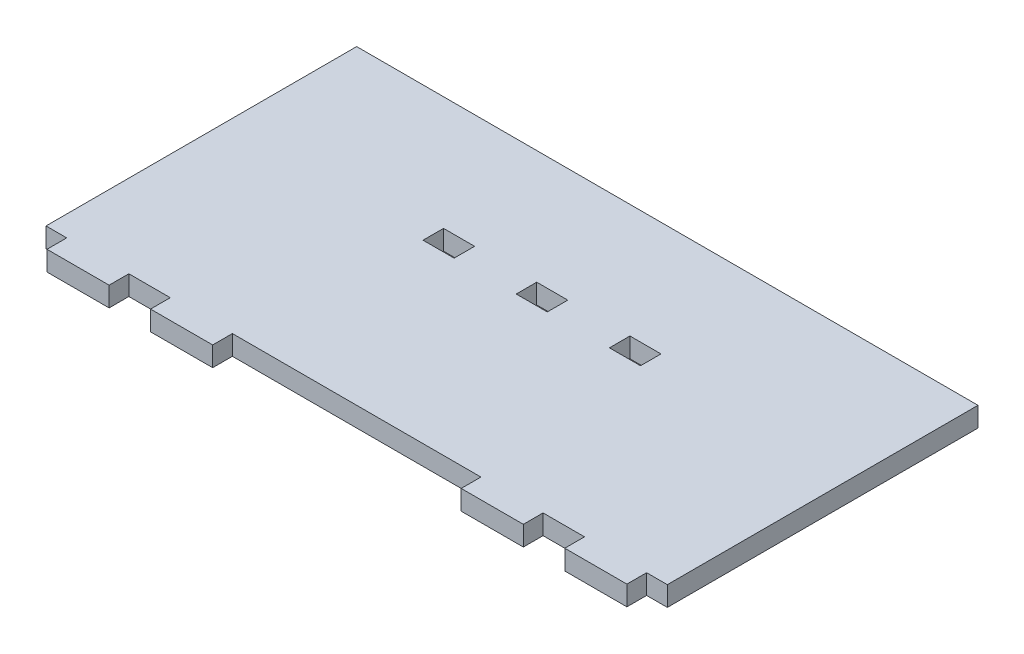
ISO-10303-21;
HEADER;
FILE_DESCRIPTION(('STEP AP214'),'2;1');
FILE_NAME('part.step','',(''),(''),'','','');
FILE_SCHEMA(('AUTOMOTIVE_DESIGN { 1 0 10303 214 1 1 1 1 }'));
ENDSEC;
DATA;
#1=APPLICATION_CONTEXT('core data for automotive mechanical design processes');
#2=APPLICATION_PROTOCOL_DEFINITION('international standard','automotive_design',2000,#1);
#3=PRODUCT_CONTEXT('',#1,'mechanical');
#4=PRODUCT('Part','Part','',(#3));
#5=PRODUCT_RELATED_PRODUCT_CATEGORY('part','',(#4));
#6=PRODUCT_DEFINITION_FORMATION('','',#4);
#7=PRODUCT_DEFINITION_CONTEXT('part definition',#1,'design');
#8=PRODUCT_DEFINITION('design','',#6,#7);
#9=PRODUCT_DEFINITION_SHAPE('','',#8);
#10=(LENGTH_UNIT() NAMED_UNIT(*) SI_UNIT(.MILLI.,.METRE.));
#11=(NAMED_UNIT(*) PLANE_ANGLE_UNIT() SI_UNIT($,.RADIAN.));
#12=(NAMED_UNIT(*) SI_UNIT($,.STERADIAN.) SOLID_ANGLE_UNIT());
#13=UNCERTAINTY_MEASURE_WITH_UNIT(LENGTH_MEASURE(1.E-05),#10,'distance_accuracy_value','');
#14=(GEOMETRIC_REPRESENTATION_CONTEXT(3) GLOBAL_UNCERTAINTY_ASSIGNED_CONTEXT((#13)) GLOBAL_UNIT_ASSIGNED_CONTEXT((#10,
#11,#12)) REPRESENTATION_CONTEXT('',''));
#15=CARTESIAN_POINT('',(0.,0.,0.));
#16=DIRECTION('',(0.,0.,1.));
#17=DIRECTION('',(1.,0.,0.));
#18=AXIS2_PLACEMENT_3D('',#15,#16,#17);
#19=CARTESIAN_POINT('',(46.6666666666666,3.175,25.));
#20=DIRECTION('',(0.,0.,-1.));
#21=DIRECTION('',(-1.,0.,0.));
#22=AXIS2_PLACEMENT_3D('',#19,#20,#21);
#23=PLANE('',#22);
#24=DIRECTION('',(1.,0.,0.));
#25=VECTOR('',#24,1.);
#26=CARTESIAN_POINT('',(46.6666666666666,0.,25.));
#27=LINE('',#26,#25);
#28=CARTESIAN_POINT('',(46.6666666666666,0.,25.));
#29=VERTEX_POINT('',#28);
#30=CARTESIAN_POINT('',(50.,0.,25.));
#31=VERTEX_POINT('',#30);
#32=EDGE_CURVE('E339',#29,#31,#27,.T.);
#33=ORIENTED_EDGE('',*,*,#32,.T.);
#34=DIRECTION('',(0.,-1.,0.));
#35=VECTOR('',#34,1.);
#36=CARTESIAN_POINT('',(50.,3.175,25.));
#37=LINE('',#36,#35);
#38=CARTESIAN_POINT('',(50.,3.175,25.));
#39=VERTEX_POINT('',#38);
#40=EDGE_CURVE('E11',#39,#31,#37,.T.);
#41=ORIENTED_EDGE('',*,*,#40,.F.);
#42=DIRECTION('',(1.,0.,0.));
#43=VECTOR('',#42,1.);
#44=CARTESIAN_POINT('',(46.6666666666666,3.175,25.));
#45=LINE('',#44,#43);
#46=CARTESIAN_POINT('',(46.6666666666666,3.175,25.));
#47=VERTEX_POINT('',#46);
#48=EDGE_CURVE('E346',#47,#39,#45,.T.);
#49=ORIENTED_EDGE('',*,*,#48,.F.);
#50=DIRECTION('',(0.,-1.,0.));
#51=VECTOR('',#50,1.);
#52=CARTESIAN_POINT('',(46.6666666666666,3.175,25.));
#53=LINE('',#52,#51);
#54=EDGE_CURVE('E388',#47,#29,#53,.T.);
#55=ORIENTED_EDGE('',*,*,#54,.T.);
#56=EDGE_LOOP('',(#33,#41,#49,#55));
#57=FACE_BOUND('',#56,.T.);
#58=ADVANCED_FACE('F36',(#57),#23,.F.);
#59=CARTESIAN_POINT('',(50.,3.175,-25.));
#60=DIRECTION('',(-1.,0.,0.));
#61=DIRECTION('',(0.,0.,1.));
#62=AXIS2_PLACEMENT_3D('',#59,#60,#61);
#63=PLANE('',#62);
#64=DIRECTION('',(0.,0.,-1.));
#65=VECTOR('',#64,1.);
#66=CARTESIAN_POINT('',(50.,0.,-25.));
#67=LINE('',#66,#65);
#68=CARTESIAN_POINT('',(50.,0.,-25.));
#69=VERTEX_POINT('',#68);
#70=EDGE_CURVE('E391',#31,#69,#67,.T.);
#71=ORIENTED_EDGE('',*,*,#70,.T.);
#72=DIRECTION('',(0.,-1.,0.));
#73=VECTOR('',#72,1.);
#74=CARTESIAN_POINT('',(50.,3.175,-25.));
#75=LINE('',#74,#73);
#76=CARTESIAN_POINT('',(50.,3.175,-25.));
#77=VERTEX_POINT('',#76);
#78=EDGE_CURVE('E43',#77,#69,#75,.T.);
#79=ORIENTED_EDGE('',*,*,#78,.F.);
#80=DIRECTION('',(0.,0.,-1.));
#81=VECTOR('',#80,1.);
#82=CARTESIAN_POINT('',(50.,3.175,-25.));
#83=LINE('',#82,#81);
#84=EDGE_CURVE('E349',#39,#77,#83,.T.);
#85=ORIENTED_EDGE('',*,*,#84,.F.);
#86=ORIENTED_EDGE('',*,*,#40,.T.);
#87=EDGE_LOOP('',(#71,#79,#85,#86));
#88=FACE_BOUND('',#87,.T.);
#89=ADVANCED_FACE('F507',(#88),#63,.F.);
#90=CARTESIAN_POINT('',(-50.0000000000001,3.175,-25.));
#91=DIRECTION('',(0.,0.,1.));
#92=DIRECTION('',(1.,0.,0.));
#93=AXIS2_PLACEMENT_3D('',#90,#91,#92);
#94=PLANE('',#93);
#95=DIRECTION('',(-1.,0.,0.));
#96=VECTOR('',#95,1.);
#97=CARTESIAN_POINT('',(-50.0000000000001,0.,-25.));
#98=LINE('',#97,#96);
#99=CARTESIAN_POINT('',(-50.0000000000001,0.,-25.));
#100=VERTEX_POINT('',#99);
#101=EDGE_CURVE('E393',#69,#100,#98,.T.);
#102=ORIENTED_EDGE('',*,*,#101,.T.);
#103=DIRECTION('',(0.,-1.,0.));
#104=VECTOR('',#103,1.);
#105=CARTESIAN_POINT('',(-50.0000000000001,3.175,-25.));
#106=LINE('',#105,#104);
#107=CARTESIAN_POINT('',(-50.0000000000001,3.175,-25.));
#108=VERTEX_POINT('',#107);
#109=EDGE_CURVE('E478',#108,#100,#106,.T.);
#110=ORIENTED_EDGE('',*,*,#109,.F.);
#111=DIRECTION('',(-1.,0.,0.));
#112=VECTOR('',#111,1.);
#113=CARTESIAN_POINT('',(-50.0000000000001,3.175,-25.));
#114=LINE('',#113,#112);
#115=EDGE_CURVE('E352',#77,#108,#114,.T.);
#116=ORIENTED_EDGE('',*,*,#115,.F.);
#117=ORIENTED_EDGE('',*,*,#78,.T.);
#118=EDGE_LOOP('',(#102,#110,#116,#117));
#119=FACE_BOUND('',#118,.T.);
#120=ADVANCED_FACE('F485',(#119),#94,.F.);
#121=CARTESIAN_POINT('',(-50.0000000000001,3.175,-25.));
#122=DIRECTION('',(1.,0.,0.));
#123=DIRECTION('',(0.,0.,-1.));
#124=AXIS2_PLACEMENT_3D('',#121,#122,#123);
#125=PLANE('',#124);
#126=DIRECTION('',(0.,0.,1.));
#127=VECTOR('',#126,1.);
#128=CARTESIAN_POINT('',(-50.0000000000001,0.,-25.));
#129=LINE('',#128,#127);
#130=CARTESIAN_POINT('',(-50.0000000000001,0.,25.));
#131=VERTEX_POINT('',#130);
#132=EDGE_CURVE('E395',#100,#131,#129,.T.);
#133=ORIENTED_EDGE('',*,*,#132,.T.);
#134=DIRECTION('',(0.,-1.,0.));
#135=VECTOR('',#134,1.);
#136=CARTESIAN_POINT('',(-50.0000000000001,3.175,25.));
#137=LINE('',#136,#135);
#138=CARTESIAN_POINT('',(-50.0000000000001,3.175,25.));
#139=VERTEX_POINT('',#138);
#140=EDGE_CURVE('E475',#139,#131,#137,.T.);
#141=ORIENTED_EDGE('',*,*,#140,.F.);
#142=DIRECTION('',(0.,0.,1.));
#143=VECTOR('',#142,1.);
#144=CARTESIAN_POINT('',(-50.0000000000001,3.175,-25.));
#145=LINE('',#144,#143);
#146=EDGE_CURVE('E354',#108,#139,#145,.T.);
#147=ORIENTED_EDGE('',*,*,#146,.F.);
#148=ORIENTED_EDGE('',*,*,#109,.T.);
#149=EDGE_LOOP('',(#133,#141,#147,#148));
#150=FACE_BOUND('',#149,.T.);
#151=ADVANCED_FACE('F495',(#150),#125,.F.);
#152=CARTESIAN_POINT('',(-50.0000000000001,3.175,25.));
#153=DIRECTION('',(0.,0.,-1.));
#154=DIRECTION('',(-1.,0.,0.));
#155=AXIS2_PLACEMENT_3D('',#152,#153,#154);
#156=PLANE('',#155);
#157=DIRECTION('',(1.,0.,0.));
#158=VECTOR('',#157,1.);
#159=CARTESIAN_POINT('',(-50.0000000000001,0.,25.));
#160=LINE('',#159,#158);
#161=CARTESIAN_POINT('',(-46.6666666666667,0.,25.));
#162=VERTEX_POINT('',#161);
#163=EDGE_CURVE('E397',#131,#162,#160,.T.);
#164=ORIENTED_EDGE('',*,*,#163,.T.);
#165=DIRECTION('',(0.,-1.,0.));
#166=VECTOR('',#165,1.);
#167=CARTESIAN_POINT('',(-46.6666666666667,3.175,25.));
#168=LINE('',#167,#166);
#169=CARTESIAN_POINT('',(-46.6666666666667,3.175,25.));
#170=VERTEX_POINT('',#169);
#171=EDGE_CURVE('E472',#170,#162,#168,.T.);
#172=ORIENTED_EDGE('',*,*,#171,.F.);
#173=DIRECTION('',(1.,0.,0.));
#174=VECTOR('',#173,1.);
#175=CARTESIAN_POINT('',(-50.0000000000001,3.175,25.));
#176=LINE('',#175,#174);
#177=EDGE_CURVE('E356',#139,#170,#176,.T.);
#178=ORIENTED_EDGE('',*,*,#177,.F.);
#179=ORIENTED_EDGE('',*,*,#140,.T.);
#180=EDGE_LOOP('',(#164,#172,#178,#179));
#181=FACE_BOUND('',#180,.T.);
#182=ADVANCED_FACE('F499',(#181),#156,.F.);
#183=CARTESIAN_POINT('',(-46.6666666666667,3.175,25.));
#184=DIRECTION('',(1.,0.,0.));
#185=DIRECTION('',(0.,0.,-1.));
#186=AXIS2_PLACEMENT_3D('',#183,#184,#185);
#187=PLANE('',#186);
#188=DIRECTION('',(0.,0.,1.));
#189=VECTOR('',#188,1.);
#190=CARTESIAN_POINT('',(-46.6666666666667,0.,25.));
#191=LINE('',#190,#189);
#192=CARTESIAN_POINT('',(-46.6666666666666,0.,28.175));
#193=VERTEX_POINT('',#192);
#194=EDGE_CURVE('E399',#162,#193,#191,.T.);
#195=ORIENTED_EDGE('',*,*,#194,.T.);
#196=DIRECTION('',(0.,-1.,0.));
#197=VECTOR('',#196,1.);
#198=CARTESIAN_POINT('',(-46.6666666666666,3.175,28.175));
#199=LINE('',#198,#197);
#200=CARTESIAN_POINT('',(-46.6666666666666,3.175,28.175));
#201=VERTEX_POINT('',#200);
#202=EDGE_CURVE('E469',#201,#193,#199,.T.);
#203=ORIENTED_EDGE('',*,*,#202,.F.);
#204=DIRECTION('',(0.,0.,1.));
#205=VECTOR('',#204,1.);
#206=CARTESIAN_POINT('',(-46.6666666666667,3.175,25.));
#207=LINE('',#206,#205);
#208=EDGE_CURVE('E358',#170,#201,#207,.T.);
#209=ORIENTED_EDGE('',*,*,#208,.F.);
#210=ORIENTED_EDGE('',*,*,#171,.T.);
#211=EDGE_LOOP('',(#195,#203,#209,#210));
#212=FACE_BOUND('',#211,.T.);
#213=ADVANCED_FACE('F580',(#212),#187,.F.);
#214=CARTESIAN_POINT('',(-46.6666666666666,3.175,28.175));
#215=DIRECTION('',(0.,0.,-1.));
#216=DIRECTION('',(-1.,0.,0.));
#217=AXIS2_PLACEMENT_3D('',#214,#215,#216);
#218=PLANE('',#217);
#219=DIRECTION('',(1.,0.,0.));
#220=VECTOR('',#219,1.);
#221=CARTESIAN_POINT('',(-46.6666666666666,0.,28.175));
#222=LINE('',#221,#220);
#223=CARTESIAN_POINT('',(-36.6666666666666,0.,28.175));
#224=VERTEX_POINT('',#223);
#225=EDGE_CURVE('E401',#193,#224,#222,.T.);
#226=ORIENTED_EDGE('',*,*,#225,.T.);
#227=DIRECTION('',(0.,-1.,0.));
#228=VECTOR('',#227,1.);
#229=CARTESIAN_POINT('',(-36.6666666666666,3.175,28.175));
#230=LINE('',#229,#228);
#231=CARTESIAN_POINT('',(-36.6666666666666,3.175,28.175));
#232=VERTEX_POINT('',#231);
#233=EDGE_CURVE('E466',#232,#224,#230,.T.);
#234=ORIENTED_EDGE('',*,*,#233,.F.);
#235=DIRECTION('',(1.,0.,0.));
#236=VECTOR('',#235,1.);
#237=CARTESIAN_POINT('',(-46.6666666666666,3.175,28.175));
#238=LINE('',#237,#236);
#239=EDGE_CURVE('E360',#201,#232,#238,.T.);
#240=ORIENTED_EDGE('',*,*,#239,.F.);
#241=ORIENTED_EDGE('',*,*,#202,.T.);
#242=EDGE_LOOP('',(#226,#234,#240,#241));
#243=FACE_BOUND('',#242,.T.);
#244=ADVANCED_FACE('F578',(#243),#218,.F.);
#245=CARTESIAN_POINT('',(-36.6666666666667,3.175,25.));
#246=DIRECTION('',(-1.,0.,0.));
#247=DIRECTION('',(0.,0.,1.));
#248=AXIS2_PLACEMENT_3D('',#245,#246,#247);
#249=PLANE('',#248);
#250=DIRECTION('',(0.,0.,-1.));
#251=VECTOR('',#250,1.);
#252=CARTESIAN_POINT('',(-36.6666666666667,0.,25.));
#253=LINE('',#252,#251);
#254=CARTESIAN_POINT('',(-36.6666666666667,0.,25.));
#255=VERTEX_POINT('',#254);
#256=EDGE_CURVE('E403',#224,#255,#253,.T.);
#257=ORIENTED_EDGE('',*,*,#256,.T.);
#258=DIRECTION('',(0.,-1.,0.));
#259=VECTOR('',#258,1.);
#260=CARTESIAN_POINT('',(-36.6666666666667,3.175,25.));
#261=LINE('',#260,#259);
#262=CARTESIAN_POINT('',(-36.6666666666667,3.175,25.));
#263=VERTEX_POINT('',#262);
#264=EDGE_CURVE('E463',#263,#255,#261,.T.);
#265=ORIENTED_EDGE('',*,*,#264,.F.);
#266=DIRECTION('',(0.,0.,-1.));
#267=VECTOR('',#266,1.);
#268=CARTESIAN_POINT('',(-36.6666666666667,3.175,25.));
#269=LINE('',#268,#267);
#270=EDGE_CURVE('E362',#232,#263,#269,.T.);
#271=ORIENTED_EDGE('',*,*,#270,.F.);
#272=ORIENTED_EDGE('',*,*,#233,.T.);
#273=EDGE_LOOP('',(#257,#265,#271,#272));
#274=FACE_BOUND('',#273,.T.);
#275=ADVANCED_FACE('F573',(#274),#249,.F.);
#276=CARTESIAN_POINT('',(-36.6666666666667,3.175,25.));
#277=DIRECTION('',(0.,0.,-1.));
#278=DIRECTION('',(-1.,0.,0.));
#279=AXIS2_PLACEMENT_3D('',#276,#277,#278);
#280=PLANE('',#279);
#281=DIRECTION('',(1.,0.,0.));
#282=VECTOR('',#281,1.);
#283=CARTESIAN_POINT('',(-36.6666666666667,0.,25.));
#284=LINE('',#283,#282);
#285=CARTESIAN_POINT('',(-30.0000000000001,0.,25.));
#286=VERTEX_POINT('',#285);
#287=EDGE_CURVE('E405',#255,#286,#284,.T.);
#288=ORIENTED_EDGE('',*,*,#287,.T.);
#289=DIRECTION('',(0.,-1.,0.));
#290=VECTOR('',#289,1.);
#291=CARTESIAN_POINT('',(-30.0000000000001,3.175,25.));
#292=LINE('',#291,#290);
#293=CARTESIAN_POINT('',(-30.0000000000001,3.175,25.));
#294=VERTEX_POINT('',#293);
#295=EDGE_CURVE('E460',#294,#286,#292,.T.);
#296=ORIENTED_EDGE('',*,*,#295,.F.);
#297=DIRECTION('',(1.,0.,0.));
#298=VECTOR('',#297,1.);
#299=CARTESIAN_POINT('',(-36.6666666666667,3.175,25.));
#300=LINE('',#299,#298);
#301=EDGE_CURVE('E364',#263,#294,#300,.T.);
#302=ORIENTED_EDGE('',*,*,#301,.F.);
#303=ORIENTED_EDGE('',*,*,#264,.T.);
#304=EDGE_LOOP('',(#288,#296,#302,#303));
#305=FACE_BOUND('',#304,.T.);
#306=ADVANCED_FACE('F568',(#305),#280,.F.);
#307=CARTESIAN_POINT('',(-30.0000000000001,3.175,25.));
#308=DIRECTION('',(1.,0.,0.));
#309=DIRECTION('',(0.,0.,-1.));
#310=AXIS2_PLACEMENT_3D('',#307,#308,#309);
#311=PLANE('',#310);
#312=DIRECTION('',(0.,0.,1.));
#313=VECTOR('',#312,1.);
#314=CARTESIAN_POINT('',(-30.0000000000001,0.,25.));
#315=LINE('',#314,#313);
#316=CARTESIAN_POINT('',(-30.0000000000001,0.,28.175));
#317=VERTEX_POINT('',#316);
#318=EDGE_CURVE('E407',#286,#317,#315,.T.);
#319=ORIENTED_EDGE('',*,*,#318,.T.);
#320=DIRECTION('',(0.,-1.,0.));
#321=VECTOR('',#320,1.);
#322=CARTESIAN_POINT('',(-30.0000000000001,3.175,28.175));
#323=LINE('',#322,#321);
#324=CARTESIAN_POINT('',(-30.0000000000001,3.175,28.175));
#325=VERTEX_POINT('',#324);
#326=EDGE_CURVE('E457',#325,#317,#323,.T.);
#327=ORIENTED_EDGE('',*,*,#326,.F.);
#328=DIRECTION('',(0.,0.,1.));
#329=VECTOR('',#328,1.);
#330=CARTESIAN_POINT('',(-30.0000000000001,3.175,25.));
#331=LINE('',#330,#329);
#332=EDGE_CURVE('E366',#294,#325,#331,.T.);
#333=ORIENTED_EDGE('',*,*,#332,.F.);
#334=ORIENTED_EDGE('',*,*,#295,.T.);
#335=EDGE_LOOP('',(#319,#327,#333,#334));
#336=FACE_BOUND('',#335,.T.);
#337=ADVANCED_FACE('F564',(#336),#311,.F.);
#338=CARTESIAN_POINT('',(-30.0000000000001,3.175,28.175));
#339=DIRECTION('',(0.,0.,-1.));
#340=DIRECTION('',(-1.,0.,0.));
#341=AXIS2_PLACEMENT_3D('',#338,#339,#340);
#342=PLANE('',#341);
#343=DIRECTION('',(1.,0.,0.));
#344=VECTOR('',#343,1.);
#345=CARTESIAN_POINT('',(-30.0000000000001,0.,28.175));
#346=LINE('',#345,#344);
#347=CARTESIAN_POINT('',(-20.0000000000001,0.,28.175));
#348=VERTEX_POINT('',#347);
#349=EDGE_CURVE('E409',#317,#348,#346,.T.);
#350=ORIENTED_EDGE('',*,*,#349,.T.);
#351=DIRECTION('',(0.,-1.,0.));
#352=VECTOR('',#351,1.);
#353=CARTESIAN_POINT('',(-20.0000000000001,3.175,28.175));
#354=LINE('',#353,#352);
#355=CARTESIAN_POINT('',(-20.0000000000001,3.175,28.175));
#356=VERTEX_POINT('',#355);
#357=EDGE_CURVE('E454',#356,#348,#354,.T.);
#358=ORIENTED_EDGE('',*,*,#357,.F.);
#359=DIRECTION('',(1.,0.,0.));
#360=VECTOR('',#359,1.);
#361=CARTESIAN_POINT('',(-30.0000000000001,3.175,28.175));
#362=LINE('',#361,#360);
#363=EDGE_CURVE('E368',#325,#356,#362,.T.);
#364=ORIENTED_EDGE('',*,*,#363,.F.);
#365=ORIENTED_EDGE('',*,*,#326,.T.);
#366=EDGE_LOOP('',(#350,#358,#364,#365));
#367=FACE_BOUND('',#366,.T.);
#368=ADVANCED_FACE('F559',(#367),#342,.F.);
#369=CARTESIAN_POINT('',(-20.0000000000001,3.175,25.));
#370=DIRECTION('',(-1.,0.,0.));
#371=DIRECTION('',(0.,0.,1.));
#372=AXIS2_PLACEMENT_3D('',#369,#370,#371);
#373=PLANE('',#372);
#374=DIRECTION('',(0.,0.,-1.));
#375=VECTOR('',#374,1.);
#376=CARTESIAN_POINT('',(-20.0000000000001,0.,25.));
#377=LINE('',#376,#375);
#378=CARTESIAN_POINT('',(-20.0000000000001,0.,25.));
#379=VERTEX_POINT('',#378);
#380=EDGE_CURVE('E411',#348,#379,#377,.T.);
#381=ORIENTED_EDGE('',*,*,#380,.T.);
#382=DIRECTION('',(0.,-1.,0.));
#383=VECTOR('',#382,1.);
#384=CARTESIAN_POINT('',(-20.0000000000001,3.175,25.));
#385=LINE('',#384,#383);
#386=CARTESIAN_POINT('',(-20.0000000000001,3.175,25.));
#387=VERTEX_POINT('',#386);
#388=EDGE_CURVE('E451',#387,#379,#385,.T.);
#389=ORIENTED_EDGE('',*,*,#388,.F.);
#390=DIRECTION('',(0.,0.,-1.));
#391=VECTOR('',#390,1.);
#392=CARTESIAN_POINT('',(-20.0000000000001,3.175,25.));
#393=LINE('',#392,#391);
#394=EDGE_CURVE('E370',#356,#387,#393,.T.);
#395=ORIENTED_EDGE('',*,*,#394,.F.);
#396=ORIENTED_EDGE('',*,*,#357,.T.);
#397=EDGE_LOOP('',(#381,#389,#395,#396));
#398=FACE_BOUND('',#397,.T.);
#399=ADVANCED_FACE('F553',(#398),#373,.F.);
#400=CARTESIAN_POINT('',(-20.0000000000001,3.175,25.));
#401=DIRECTION('',(0.,0.,-1.));
#402=DIRECTION('',(-1.,0.,0.));
#403=AXIS2_PLACEMENT_3D('',#400,#401,#402);
#404=PLANE('',#403);
#405=DIRECTION('',(1.,0.,0.));
#406=VECTOR('',#405,1.);
#407=CARTESIAN_POINT('',(-20.0000000000001,0.,25.));
#408=LINE('',#407,#406);
#409=CARTESIAN_POINT('',(19.9999999999999,0.,25.));
#410=VERTEX_POINT('',#409);
#411=EDGE_CURVE('E413',#379,#410,#408,.T.);
#412=ORIENTED_EDGE('',*,*,#411,.T.);
#413=DIRECTION('',(0.,-1.,0.));
#414=VECTOR('',#413,1.);
#415=CARTESIAN_POINT('',(19.9999999999999,3.175,25.));
#416=LINE('',#415,#414);
#417=CARTESIAN_POINT('',(19.9999999999999,3.175,25.));
#418=VERTEX_POINT('',#417);
#419=EDGE_CURVE('E448',#418,#410,#416,.T.);
#420=ORIENTED_EDGE('',*,*,#419,.F.);
#421=DIRECTION('',(1.,0.,0.));
#422=VECTOR('',#421,1.);
#423=CARTESIAN_POINT('',(-20.0000000000001,3.175,25.));
#424=LINE('',#423,#422);
#425=EDGE_CURVE('E372',#387,#418,#424,.T.);
#426=ORIENTED_EDGE('',*,*,#425,.F.);
#427=ORIENTED_EDGE('',*,*,#388,.T.);
#428=EDGE_LOOP('',(#412,#420,#426,#427));
#429=FACE_BOUND('',#428,.T.);
#430=ADVANCED_FACE('F549',(#429),#404,.F.);
#431=CARTESIAN_POINT('',(19.9999999999999,3.175,25.));
#432=DIRECTION('',(1.,0.,0.));
#433=DIRECTION('',(0.,0.,-1.));
#434=AXIS2_PLACEMENT_3D('',#431,#432,#433);
#435=PLANE('',#434);
#436=DIRECTION('',(0.,0.,1.));
#437=VECTOR('',#436,1.);
#438=CARTESIAN_POINT('',(19.9999999999999,0.,25.));
#439=LINE('',#438,#437);
#440=CARTESIAN_POINT('',(19.9999999999999,0.,28.175));
#441=VERTEX_POINT('',#440);
#442=EDGE_CURVE('E415',#410,#441,#439,.T.);
#443=ORIENTED_EDGE('',*,*,#442,.T.);
#444=DIRECTION('',(0.,-1.,0.));
#445=VECTOR('',#444,1.);
#446=CARTESIAN_POINT('',(19.9999999999999,3.175,28.175));
#447=LINE('',#446,#445);
#448=CARTESIAN_POINT('',(19.9999999999999,3.175,28.175));
#449=VERTEX_POINT('',#448);
#450=EDGE_CURVE('E445',#449,#441,#447,.T.);
#451=ORIENTED_EDGE('',*,*,#450,.F.);
#452=DIRECTION('',(0.,0.,1.));
#453=VECTOR('',#452,1.);
#454=CARTESIAN_POINT('',(19.9999999999999,3.175,25.));
#455=LINE('',#454,#453);
#456=EDGE_CURVE('E374',#418,#449,#455,.T.);
#457=ORIENTED_EDGE('',*,*,#456,.F.);
#458=ORIENTED_EDGE('',*,*,#419,.T.);
#459=EDGE_LOOP('',(#443,#451,#457,#458));
#460=FACE_BOUND('',#459,.T.);
#461=ADVANCED_FACE('F544',(#460),#435,.F.);
#462=CARTESIAN_POINT('',(29.9999999999999,3.175,28.175));
#463=DIRECTION('',(0.,0.,-1.));
#464=DIRECTION('',(-1.,0.,0.));
#465=AXIS2_PLACEMENT_3D('',#462,#463,#464);
#466=PLANE('',#465);
#467=DIRECTION('',(1.,0.,0.));
#468=VECTOR('',#467,1.);
#469=CARTESIAN_POINT('',(29.9999999999999,0.,28.175));
#470=LINE('',#469,#468);
#471=CARTESIAN_POINT('',(29.9999999999999,0.,28.175));
#472=VERTEX_POINT('',#471);
#473=EDGE_CURVE('E417',#441,#472,#470,.T.);
#474=ORIENTED_EDGE('',*,*,#473,.T.);
#475=DIRECTION('',(0.,-1.,0.));
#476=VECTOR('',#475,1.);
#477=CARTESIAN_POINT('',(29.9999999999999,3.175,28.175));
#478=LINE('',#477,#476);
#479=CARTESIAN_POINT('',(29.9999999999999,3.175,28.175));
#480=VERTEX_POINT('',#479);
#481=EDGE_CURVE('E442',#480,#472,#478,.T.);
#482=ORIENTED_EDGE('',*,*,#481,.F.);
#483=DIRECTION('',(1.,0.,0.));
#484=VECTOR('',#483,1.);
#485=CARTESIAN_POINT('',(29.9999999999999,3.175,28.175));
#486=LINE('',#485,#484);
#487=EDGE_CURVE('E376',#449,#480,#486,.T.);
#488=ORIENTED_EDGE('',*,*,#487,.F.);
#489=ORIENTED_EDGE('',*,*,#450,.T.);
#490=EDGE_LOOP('',(#474,#482,#488,#489));
#491=FACE_BOUND('',#490,.T.);
#492=ADVANCED_FACE('F538',(#491),#466,.F.);
#493=CARTESIAN_POINT('',(29.9999999999999,3.175,25.));
#494=DIRECTION('',(-1.,0.,0.));
#495=DIRECTION('',(0.,0.,1.));
#496=AXIS2_PLACEMENT_3D('',#493,#494,#495);
#497=PLANE('',#496);
#498=DIRECTION('',(0.,0.,-1.));
#499=VECTOR('',#498,1.);
#500=CARTESIAN_POINT('',(29.9999999999999,0.,25.));
#501=LINE('',#500,#499);
#502=CARTESIAN_POINT('',(29.9999999999999,0.,25.));
#503=VERTEX_POINT('',#502);
#504=EDGE_CURVE('E419',#472,#503,#501,.T.);
#505=ORIENTED_EDGE('',*,*,#504,.T.);
#506=DIRECTION('',(0.,-1.,0.));
#507=VECTOR('',#506,1.);
#508=CARTESIAN_POINT('',(29.9999999999999,3.175,25.));
#509=LINE('',#508,#507);
#510=CARTESIAN_POINT('',(29.9999999999999,3.175,25.));
#511=VERTEX_POINT('',#510);
#512=EDGE_CURVE('E439',#511,#503,#509,.T.);
#513=ORIENTED_EDGE('',*,*,#512,.F.);
#514=DIRECTION('',(0.,0.,-1.));
#515=VECTOR('',#514,1.);
#516=CARTESIAN_POINT('',(29.9999999999999,3.175,25.));
#517=LINE('',#516,#515);
#518=EDGE_CURVE('E378',#480,#511,#517,.T.);
#519=ORIENTED_EDGE('',*,*,#518,.F.);
#520=ORIENTED_EDGE('',*,*,#481,.T.);
#521=EDGE_LOOP('',(#505,#513,#519,#520));
#522=FACE_BOUND('',#521,.T.);
#523=ADVANCED_FACE('F534',(#522),#497,.F.);
#524=CARTESIAN_POINT('',(29.9999999999999,3.175,25.));
#525=DIRECTION('',(0.,0.,-1.));
#526=DIRECTION('',(-1.,0.,0.));
#527=AXIS2_PLACEMENT_3D('',#524,#525,#526);
#528=PLANE('',#527);
#529=DIRECTION('',(1.,0.,0.));
#530=VECTOR('',#529,1.);
#531=CARTESIAN_POINT('',(29.9999999999999,0.,25.));
#532=LINE('',#531,#530);
#533=CARTESIAN_POINT('',(36.6666666666666,0.,25.));
#534=VERTEX_POINT('',#533);
#535=EDGE_CURVE('E421',#503,#534,#532,.T.);
#536=ORIENTED_EDGE('',*,*,#535,.T.);
#537=DIRECTION('',(0.,-1.,0.));
#538=VECTOR('',#537,1.);
#539=CARTESIAN_POINT('',(36.6666666666666,3.175,25.));
#540=LINE('',#539,#538);
#541=CARTESIAN_POINT('',(36.6666666666666,3.175,25.));
#542=VERTEX_POINT('',#541);
#543=EDGE_CURVE('E436',#542,#534,#540,.T.);
#544=ORIENTED_EDGE('',*,*,#543,.F.);
#545=DIRECTION('',(1.,0.,0.));
#546=VECTOR('',#545,1.);
#547=CARTESIAN_POINT('',(29.9999999999999,3.175,25.));
#548=LINE('',#547,#546);
#549=EDGE_CURVE('E380',#511,#542,#548,.T.);
#550=ORIENTED_EDGE('',*,*,#549,.F.);
#551=ORIENTED_EDGE('',*,*,#512,.T.);
#552=EDGE_LOOP('',(#536,#544,#550,#551));
#553=FACE_BOUND('',#552,.T.);
#554=ADVANCED_FACE('F529',(#553),#528,.F.);
#555=CARTESIAN_POINT('',(36.6666666666666,3.175,25.));
#556=DIRECTION('',(1.,0.,0.));
#557=DIRECTION('',(0.,0.,-1.));
#558=AXIS2_PLACEMENT_3D('',#555,#556,#557);
#559=PLANE('',#558);
#560=DIRECTION('',(0.,0.,1.));
#561=VECTOR('',#560,1.);
#562=CARTESIAN_POINT('',(36.6666666666666,0.,25.));
#563=LINE('',#562,#561);
#564=CARTESIAN_POINT('',(36.6666666666665,0.,28.175));
#565=VERTEX_POINT('',#564);
#566=EDGE_CURVE('E423',#534,#565,#563,.T.);
#567=ORIENTED_EDGE('',*,*,#566,.T.);
#568=DIRECTION('',(0.,-1.,0.));
#569=VECTOR('',#568,1.);
#570=CARTESIAN_POINT('',(36.6666666666665,3.175,28.175));
#571=LINE('',#570,#569);
#572=CARTESIAN_POINT('',(36.6666666666665,3.175,28.175));
#573=VERTEX_POINT('',#572);
#574=EDGE_CURVE('E433',#573,#565,#571,.T.);
#575=ORIENTED_EDGE('',*,*,#574,.F.);
#576=DIRECTION('',(0.,0.,1.));
#577=VECTOR('',#576,1.);
#578=CARTESIAN_POINT('',(36.6666666666666,3.175,25.));
#579=LINE('',#578,#577);
#580=EDGE_CURVE('E382',#542,#573,#579,.T.);
#581=ORIENTED_EDGE('',*,*,#580,.F.);
#582=ORIENTED_EDGE('',*,*,#543,.T.);
#583=EDGE_LOOP('',(#567,#575,#581,#582));
#584=FACE_BOUND('',#583,.T.);
#585=ADVANCED_FACE('F523',(#584),#559,.F.);
#586=CARTESIAN_POINT('',(46.6666666666665,3.175,28.175));
#587=DIRECTION('',(0.,0.,-1.));
#588=DIRECTION('',(-1.,0.,0.));
#589=AXIS2_PLACEMENT_3D('',#586,#587,#588);
#590=PLANE('',#589);
#591=DIRECTION('',(1.,0.,0.));
#592=VECTOR('',#591,1.);
#593=CARTESIAN_POINT('',(46.6666666666665,0.,28.175));
#594=LINE('',#593,#592);
#595=CARTESIAN_POINT('',(46.6666666666665,0.,28.175));
#596=VERTEX_POINT('',#595);
#597=EDGE_CURVE('E425',#565,#596,#594,.T.);
#598=ORIENTED_EDGE('',*,*,#597,.T.);
#599=DIRECTION('',(0.,-1.,0.));
#600=VECTOR('',#599,1.);
#601=CARTESIAN_POINT('',(46.6666666666665,3.175,28.175));
#602=LINE('',#601,#600);
#603=CARTESIAN_POINT('',(46.6666666666665,3.175,28.175));
#604=VERTEX_POINT('',#603);
#605=EDGE_CURVE('E430',#604,#596,#602,.T.);
#606=ORIENTED_EDGE('',*,*,#605,.F.);
#607=DIRECTION('',(1.,0.,0.));
#608=VECTOR('',#607,1.);
#609=CARTESIAN_POINT('',(46.6666666666665,3.175,28.175));
#610=LINE('',#609,#608);
#611=EDGE_CURVE('E384',#573,#604,#610,.T.);
#612=ORIENTED_EDGE('',*,*,#611,.F.);
#613=ORIENTED_EDGE('',*,*,#574,.T.);
#614=EDGE_LOOP('',(#598,#606,#612,#613));
#615=FACE_BOUND('',#614,.T.);
#616=ADVANCED_FACE('F519',(#615),#590,.F.);
#617=CARTESIAN_POINT('',(46.6666666666666,3.175,25.));
#618=DIRECTION('',(-1.,0.,0.));
#619=DIRECTION('',(0.,0.,1.));
#620=AXIS2_PLACEMENT_3D('',#617,#618,#619);
#621=PLANE('',#620);
#622=DIRECTION('',(0.,0.,-1.));
#623=VECTOR('',#622,1.);
#624=CARTESIAN_POINT('',(46.6666666666666,0.,25.));
#625=LINE('',#624,#623);
#626=EDGE_CURVE('E350',#596,#29,#625,.T.);
#627=ORIENTED_EDGE('',*,*,#626,.T.);
#628=ORIENTED_EDGE('',*,*,#54,.F.);
#629=DIRECTION('',(0.,0.,-1.));
#630=VECTOR('',#629,1.);
#631=CARTESIAN_POINT('',(46.6666666666666,3.175,25.));
#632=LINE('',#631,#630);
#633=EDGE_CURVE('E386',#604,#47,#632,.T.);
#634=ORIENTED_EDGE('',*,*,#633,.F.);
#635=ORIENTED_EDGE('',*,*,#605,.T.);
#636=EDGE_LOOP('',(#627,#628,#634,#635));
#637=FACE_BOUND('',#636,.T.);
#638=ADVANCED_FACE('F514',(#637),#621,.F.);
#639=CARTESIAN_POINT('',(0.,3.175,0.));
#640=DIRECTION('',(0.,-1.,0.));
#641=DIRECTION('',(0.,0.,-1.));
#642=AXIS2_PLACEMENT_3D('',#639,#640,#641);
#643=PLANE('',#642);
#644=DIRECTION('',(1.,0.,0.));
#645=VECTOR('',#644,1.);
#646=CARTESIAN_POINT('',(17.3304025027512,3.175,-3.35000000000001));
#647=LINE('',#646,#645);
#648=CARTESIAN_POINT('',(12.3304025027512,3.175,-3.35000000000001));
#649=VERTEX_POINT('',#648);
#650=CARTESIAN_POINT('',(17.3304025027512,3.175,-3.35000000000001));
#651=VERTEX_POINT('',#650);
#652=EDGE_CURVE('E300',#649,#651,#647,.T.);
#653=ORIENTED_EDGE('',*,*,#652,.F.);
#654=DIRECTION('',(0.,0.,1.));
#655=VECTOR('',#654,1.);
#656=CARTESIAN_POINT('',(12.3304025027512,3.175,-3.35000000000001));
#657=LINE('',#656,#655);
#658=CARTESIAN_POINT('',(12.3304025027512,3.175,-6.65000000000001));
#659=VERTEX_POINT('',#658);
#660=EDGE_CURVE('E50',#659,#649,#657,.T.);
#661=ORIENTED_EDGE('',*,*,#660,.F.);
#662=DIRECTION('',(-1.,0.,0.));
#663=VECTOR('',#662,1.);
#664=CARTESIAN_POINT('',(17.3304025027512,3.175,-6.65000000000001));
#665=LINE('',#664,#663);
#666=CARTESIAN_POINT('',(17.3304025027512,3.175,-6.65000000000001));
#667=VERTEX_POINT('',#666);
#668=EDGE_CURVE('E289',#667,#659,#665,.T.);
#669=ORIENTED_EDGE('',*,*,#668,.F.);
#670=DIRECTION('',(0.,0.,-1.));
#671=VECTOR('',#670,1.);
#672=CARTESIAN_POINT('',(17.3304025027512,3.175,-3.35000000000001));
#673=LINE('',#672,#671);
#674=EDGE_CURVE('E303',#651,#667,#673,.T.);
#675=ORIENTED_EDGE('',*,*,#674,.F.);
#676=EDGE_LOOP('',(#653,#661,#669,#675));
#677=FACE_BOUND('',#676,.T.);
#678=DIRECTION('',(-1.,0.,0.));
#679=VECTOR('',#678,1.);
#680=CARTESIAN_POINT('',(-17.6695974972488,3.175,-6.65000000000001));
#681=LINE('',#680,#679);
#682=CARTESIAN_POINT('',(-12.6695974972488,3.175,-6.65000000000001));
#683=VERTEX_POINT('',#682);
#684=CARTESIAN_POINT('',(-17.6695974972488,3.175,-6.65000000000001));
#685=VERTEX_POINT('',#684);
#686=EDGE_CURVE('E274',#683,#685,#681,.T.);
#687=ORIENTED_EDGE('',*,*,#686,.F.);
#688=DIRECTION('',(0.,0.,-1.));
#689=VECTOR('',#688,1.);
#690=CARTESIAN_POINT('',(-12.6695974972488,3.175,-3.35000000000001));
#691=LINE('',#690,#689);
#692=CARTESIAN_POINT('',(-12.6695974972488,3.175,-3.35000000000001));
#693=VERTEX_POINT('',#692);
#694=EDGE_CURVE('E58',#693,#683,#691,.T.);
#695=ORIENTED_EDGE('',*,*,#694,.F.);
#696=DIRECTION('',(1.,0.,0.));
#697=VECTOR('',#696,1.);
#698=CARTESIAN_POINT('',(-17.6695974972488,3.175,-3.35000000000001));
#699=LINE('',#698,#697);
#700=CARTESIAN_POINT('',(-17.6695974972488,3.175,-3.35000000000001));
#701=VERTEX_POINT('',#700);
#702=EDGE_CURVE('E265',#701,#693,#699,.T.);
#703=ORIENTED_EDGE('',*,*,#702,.F.);
#704=DIRECTION('',(0.,0.,1.));
#705=VECTOR('',#704,1.);
#706=CARTESIAN_POINT('',(-17.6695974972488,3.175,-3.35000000000001));
#707=LINE('',#706,#705);
#708=EDGE_CURVE('E268',#685,#701,#707,.T.);
#709=ORIENTED_EDGE('',*,*,#708,.F.);
#710=EDGE_LOOP('',(#687,#695,#703,#709));
#711=FACE_BOUND('',#710,.T.);
#712=DIRECTION('',(1.,0.,0.));
#713=VECTOR('',#712,1.);
#714=CARTESIAN_POINT('',(2.33040250275116,3.175,-3.35000000000001));
#715=LINE('',#714,#713);
#716=CARTESIAN_POINT('',(-2.66959749724884,3.175,-3.35000000000001));
#717=VERTEX_POINT('',#716);
#718=CARTESIAN_POINT('',(2.33040250275116,3.175,-3.35000000000001));
#719=VERTEX_POINT('',#718);
#720=EDGE_CURVE('E329',#717,#719,#715,.T.);
#721=ORIENTED_EDGE('',*,*,#720,.F.);
#722=DIRECTION('',(0.,0.,1.));
#723=VECTOR('',#722,1.);
#724=CARTESIAN_POINT('',(-2.66959749724884,3.175,-3.35000000000001));
#725=LINE('',#724,#723);
#726=CARTESIAN_POINT('',(-2.66959749724884,3.175,-6.65000000000001));
#727=VERTEX_POINT('',#726);
#728=EDGE_CURVE('E281',#727,#717,#725,.T.);
#729=ORIENTED_EDGE('',*,*,#728,.F.);
#730=DIRECTION('',(-1.,0.,0.));
#731=VECTOR('',#730,1.);
#732=CARTESIAN_POINT('',(2.33040250275116,3.175,-6.65000000000001));
#733=LINE('',#732,#731);
#734=CARTESIAN_POINT('',(2.33040250275116,3.175,-6.65000000000001));
#735=VERTEX_POINT('',#734);
#736=EDGE_CURVE('E318',#735,#727,#733,.T.);
#737=ORIENTED_EDGE('',*,*,#736,.F.);
#738=DIRECTION('',(0.,0.,-1.));
#739=VECTOR('',#738,1.);
#740=CARTESIAN_POINT('',(2.33040250275116,3.175,-3.35000000000001));
#741=LINE('',#740,#739);
#742=EDGE_CURVE('E332',#719,#735,#741,.T.);
#743=ORIENTED_EDGE('',*,*,#742,.F.);
#744=EDGE_LOOP('',(#721,#729,#737,#743));
#745=FACE_BOUND('',#744,.T.);
#746=ORIENTED_EDGE('',*,*,#48,.T.);
#747=ORIENTED_EDGE('',*,*,#84,.T.);
#748=ORIENTED_EDGE('',*,*,#115,.T.);
#749=ORIENTED_EDGE('',*,*,#146,.T.);
#750=ORIENTED_EDGE('',*,*,#177,.T.);
#751=ORIENTED_EDGE('',*,*,#208,.T.);
#752=ORIENTED_EDGE('',*,*,#239,.T.);
#753=ORIENTED_EDGE('',*,*,#270,.T.);
#754=ORIENTED_EDGE('',*,*,#301,.T.);
#755=ORIENTED_EDGE('',*,*,#332,.T.);
#756=ORIENTED_EDGE('',*,*,#363,.T.);
#757=ORIENTED_EDGE('',*,*,#394,.T.);
#758=ORIENTED_EDGE('',*,*,#425,.T.);
#759=ORIENTED_EDGE('',*,*,#456,.T.);
#760=ORIENTED_EDGE('',*,*,#487,.T.);
#761=ORIENTED_EDGE('',*,*,#518,.T.);
#762=ORIENTED_EDGE('',*,*,#549,.T.);
#763=ORIENTED_EDGE('',*,*,#580,.T.);
#764=ORIENTED_EDGE('',*,*,#611,.T.);
#765=ORIENTED_EDGE('',*,*,#633,.T.);
#766=EDGE_LOOP('',(#746,#747,#748,#749,#750,#751,#752,#753,#754,#755,#756,#757,#758,#759,#760,
#761,#762,#763,#764,#765));
#767=FACE_BOUND('',#766,.T.);
#768=ADVANCED_FACE('F503',(#677,#711,#745,#767),#643,.F.);
#769=CARTESIAN_POINT('',(0.,0.,0.));
#770=DIRECTION('',(0.,-1.,0.));
#771=DIRECTION('',(0.,0.,-1.));
#772=AXIS2_PLACEMENT_3D('',#769,#770,#771);
#773=PLANE('',#772);
#774=DIRECTION('',(0.,0.,1.));
#775=VECTOR('',#774,1.);
#776=CARTESIAN_POINT('',(12.3304025027512,0.,-3.35000000000001));
#777=LINE('',#776,#775);
#778=CARTESIAN_POINT('',(12.3304025027512,0.,-6.65000000000001));
#779=VERTEX_POINT('',#778);
#780=CARTESIAN_POINT('',(12.3304025027512,0.,-3.35000000000001));
#781=VERTEX_POINT('',#780);
#782=EDGE_CURVE('E285',#779,#781,#777,.T.);
#783=ORIENTED_EDGE('',*,*,#782,.T.);
#784=DIRECTION('',(1.,0.,0.));
#785=VECTOR('',#784,1.);
#786=CARTESIAN_POINT('',(17.3304025027512,0.,-3.35000000000001));
#787=LINE('',#786,#785);
#788=CARTESIAN_POINT('',(17.3304025027512,0.,-3.35000000000001));
#789=VERTEX_POINT('',#788);
#790=EDGE_CURVE('E288',#781,#789,#787,.T.);
#791=ORIENTED_EDGE('',*,*,#790,.T.);
#792=DIRECTION('',(0.,0.,-1.));
#793=VECTOR('',#792,1.);
#794=CARTESIAN_POINT('',(17.3304025027512,0.,-3.35000000000001));
#795=LINE('',#794,#793);
#796=CARTESIAN_POINT('',(17.3304025027512,0.,-6.65000000000001));
#797=VERTEX_POINT('',#796);
#798=EDGE_CURVE('E292',#789,#797,#795,.T.);
#799=ORIENTED_EDGE('',*,*,#798,.T.);
#800=DIRECTION('',(-1.,0.,0.));
#801=VECTOR('',#800,1.);
#802=CARTESIAN_POINT('',(17.3304025027512,0.,-6.65000000000001));
#803=LINE('',#802,#801);
#804=EDGE_CURVE('E295',#797,#779,#803,.T.);
#805=ORIENTED_EDGE('',*,*,#804,.T.);
#806=EDGE_LOOP('',(#783,#791,#799,#805));
#807=FACE_BOUND('',#806,.T.);
#808=DIRECTION('',(0.,0.,-1.));
#809=VECTOR('',#808,1.);
#810=CARTESIAN_POINT('',(-12.6695974972488,0.,-3.35000000000001));
#811=LINE('',#810,#809);
#812=CARTESIAN_POINT('',(-12.6695974972488,0.,-3.35000000000001));
#813=VERTEX_POINT('',#812);
#814=CARTESIAN_POINT('',(-12.6695974972488,0.,-6.65000000000001));
#815=VERTEX_POINT('',#814);
#816=EDGE_CURVE('E246',#813,#815,#811,.T.);
#817=ORIENTED_EDGE('',*,*,#816,.T.);
#818=DIRECTION('',(-1.,0.,0.));
#819=VECTOR('',#818,1.);
#820=CARTESIAN_POINT('',(-17.6695974972488,0.,-6.65000000000001));
#821=LINE('',#820,#819);
#822=CARTESIAN_POINT('',(-17.6695974972488,0.,-6.65000000000001));
#823=VERTEX_POINT('',#822);
#824=EDGE_CURVE('E256',#815,#823,#821,.T.);
#825=ORIENTED_EDGE('',*,*,#824,.T.);
#826=DIRECTION('',(0.,0.,1.));
#827=VECTOR('',#826,1.);
#828=CARTESIAN_POINT('',(-17.6695974972488,0.,-3.35000000000001));
#829=LINE('',#828,#827);
#830=CARTESIAN_POINT('',(-17.6695974972488,0.,-3.35000000000001));
#831=VERTEX_POINT('',#830);
#832=EDGE_CURVE('E260',#823,#831,#829,.T.);
#833=ORIENTED_EDGE('',*,*,#832,.T.);
#834=DIRECTION('',(1.,0.,0.));
#835=VECTOR('',#834,1.);
#836=CARTESIAN_POINT('',(-17.6695974972488,0.,-3.35000000000001));
#837=LINE('',#836,#835);
#838=EDGE_CURVE('E252',#831,#813,#837,.T.);
#839=ORIENTED_EDGE('',*,*,#838,.T.);
#840=EDGE_LOOP('',(#817,#825,#833,#839));
#841=FACE_BOUND('',#840,.T.);
#842=DIRECTION('',(0.,0.,1.));
#843=VECTOR('',#842,1.);
#844=CARTESIAN_POINT('',(-2.66959749724884,0.,-3.35000000000001));
#845=LINE('',#844,#843);
#846=CARTESIAN_POINT('',(-2.66959749724884,0.,-6.65000000000001));
#847=VERTEX_POINT('',#846);
#848=CARTESIAN_POINT('',(-2.66959749724884,0.,-3.35000000000001));
#849=VERTEX_POINT('',#848);
#850=EDGE_CURVE('E314',#847,#849,#845,.T.);
#851=ORIENTED_EDGE('',*,*,#850,.T.);
#852=DIRECTION('',(1.,0.,0.));
#853=VECTOR('',#852,1.);
#854=CARTESIAN_POINT('',(2.33040250275116,0.,-3.35000000000001));
#855=LINE('',#854,#853);
#856=CARTESIAN_POINT('',(2.33040250275116,0.,-3.35000000000001));
#857=VERTEX_POINT('',#856);
#858=EDGE_CURVE('E317',#849,#857,#855,.T.);
#859=ORIENTED_EDGE('',*,*,#858,.T.);
#860=DIRECTION('',(0.,0.,-1.));
#861=VECTOR('',#860,1.);
#862=CARTESIAN_POINT('',(2.33040250275116,0.,-3.35000000000001));
#863=LINE('',#862,#861);
#864=CARTESIAN_POINT('',(2.33040250275116,0.,-6.65000000000001));
#865=VERTEX_POINT('',#864);
#866=EDGE_CURVE('E321',#857,#865,#863,.T.);
#867=ORIENTED_EDGE('',*,*,#866,.T.);
#868=DIRECTION('',(-1.,0.,0.));
#869=VECTOR('',#868,1.);
#870=CARTESIAN_POINT('',(2.33040250275116,0.,-6.65000000000001));
#871=LINE('',#870,#869);
#872=EDGE_CURVE('E324',#865,#847,#871,.T.);
#873=ORIENTED_EDGE('',*,*,#872,.T.);
#874=EDGE_LOOP('',(#851,#859,#867,#873));
#875=FACE_BOUND('',#874,.T.);
#876=ORIENTED_EDGE('',*,*,#32,.F.);
#877=ORIENTED_EDGE('',*,*,#626,.F.);
#878=ORIENTED_EDGE('',*,*,#597,.F.);
#879=ORIENTED_EDGE('',*,*,#566,.F.);
#880=ORIENTED_EDGE('',*,*,#535,.F.);
#881=ORIENTED_EDGE('',*,*,#504,.F.);
#882=ORIENTED_EDGE('',*,*,#473,.F.);
#883=ORIENTED_EDGE('',*,*,#442,.F.);
#884=ORIENTED_EDGE('',*,*,#411,.F.);
#885=ORIENTED_EDGE('',*,*,#380,.F.);
#886=ORIENTED_EDGE('',*,*,#349,.F.);
#887=ORIENTED_EDGE('',*,*,#318,.F.);
#888=ORIENTED_EDGE('',*,*,#287,.F.);
#889=ORIENTED_EDGE('',*,*,#256,.F.);
#890=ORIENTED_EDGE('',*,*,#225,.F.);
#891=ORIENTED_EDGE('',*,*,#194,.F.);
#892=ORIENTED_EDGE('',*,*,#163,.F.);
#893=ORIENTED_EDGE('',*,*,#132,.F.);
#894=ORIENTED_EDGE('',*,*,#101,.F.);
#895=ORIENTED_EDGE('',*,*,#70,.F.);
#896=EDGE_LOOP('',(#876,#877,#878,#879,#880,#881,#882,#883,#884,#885,#886,#887,#888,#889,#890,
#891,#892,#893,#894,#895));
#897=FACE_BOUND('',#896,.T.);
#898=ADVANCED_FACE('F262',(#807,#841,#875,#897),#773,.T.);
#899=CARTESIAN_POINT('',(-2.66959749724884,0.,-3.35000000000001));
#900=DIRECTION('',(-1.,0.,0.));
#901=DIRECTION('',(0.,0.,1.));
#902=AXIS2_PLACEMENT_3D('',#899,#900,#901);
#903=PLANE('',#902);
#904=ORIENTED_EDGE('',*,*,#728,.T.);
#905=DIRECTION('',(0.,1.,0.));
#906=VECTOR('',#905,1.);
#907=CARTESIAN_POINT('',(-2.66959749724884,0.,-3.35000000000001));
#908=LINE('',#907,#906);
#909=EDGE_CURVE('E327',#849,#717,#908,.T.);
#910=ORIENTED_EDGE('',*,*,#909,.F.);
#911=ORIENTED_EDGE('',*,*,#850,.F.);
#912=DIRECTION('',(0.,1.,0.));
#913=VECTOR('',#912,1.);
#914=CARTESIAN_POINT('',(-2.66959749724884,0.,-6.65000000000001));
#915=LINE('',#914,#913);
#916=EDGE_CURVE('E337',#847,#727,#915,.T.);
#917=ORIENTED_EDGE('',*,*,#916,.T.);
#918=EDGE_LOOP('',(#904,#910,#911,#917));
#919=FACE_BOUND('',#918,.T.);
#920=ADVANCED_FACE('F736',(#919),#903,.F.);
#921=CARTESIAN_POINT('',(2.33040250275116,0.,-6.65000000000001));
#922=DIRECTION('',(0.,0.,-1.));
#923=DIRECTION('',(-1.,0.,0.));
#924=AXIS2_PLACEMENT_3D('',#921,#922,#923);
#925=PLANE('',#924);
#926=ORIENTED_EDGE('',*,*,#736,.T.);
#927=ORIENTED_EDGE('',*,*,#916,.F.);
#928=ORIENTED_EDGE('',*,*,#872,.F.);
#929=DIRECTION('',(0.,1.,0.));
#930=VECTOR('',#929,1.);
#931=CARTESIAN_POINT('',(2.33040250275116,0.,-6.65000000000001));
#932=LINE('',#931,#930);
#933=EDGE_CURVE('E340',#865,#735,#932,.T.);
#934=ORIENTED_EDGE('',*,*,#933,.T.);
#935=EDGE_LOOP('',(#926,#927,#928,#934));
#936=FACE_BOUND('',#935,.T.);
#937=ADVANCED_FACE('F745',(#936),#925,.F.);
#938=CARTESIAN_POINT('',(2.33040250275116,0.,-3.35000000000001));
#939=DIRECTION('',(1.,0.,0.));
#940=DIRECTION('',(0.,0.,-1.));
#941=AXIS2_PLACEMENT_3D('',#938,#939,#940);
#942=PLANE('',#941);
#943=ORIENTED_EDGE('',*,*,#742,.T.);
#944=ORIENTED_EDGE('',*,*,#933,.F.);
#945=ORIENTED_EDGE('',*,*,#866,.F.);
#946=DIRECTION('',(0.,1.,0.));
#947=VECTOR('',#946,1.);
#948=CARTESIAN_POINT('',(2.33040250275116,0.,-3.35000000000001));
#949=LINE('',#948,#947);
#950=EDGE_CURVE('E342',#857,#719,#949,.T.);
#951=ORIENTED_EDGE('',*,*,#950,.T.);
#952=EDGE_LOOP('',(#943,#944,#945,#951));
#953=FACE_BOUND('',#952,.T.);
#954=ADVANCED_FACE('F755',(#953),#942,.F.);
#955=CARTESIAN_POINT('',(2.33040250275116,0.,-3.35000000000001));
#956=DIRECTION('',(0.,0.,1.));
#957=DIRECTION('',(1.,0.,0.));
#958=AXIS2_PLACEMENT_3D('',#955,#956,#957);
#959=PLANE('',#958);
#960=ORIENTED_EDGE('',*,*,#720,.T.);
#961=ORIENTED_EDGE('',*,*,#950,.F.);
#962=ORIENTED_EDGE('',*,*,#858,.F.);
#963=ORIENTED_EDGE('',*,*,#909,.T.);
#964=EDGE_LOOP('',(#960,#961,#962,#963));
#965=FACE_BOUND('',#964,.T.);
#966=ADVANCED_FACE('F765',(#965),#959,.F.);
#967=CARTESIAN_POINT('',(-12.6695974972488,0.,-3.35000000000001));
#968=DIRECTION('',(1.,0.,0.));
#969=DIRECTION('',(0.,0.,-1.));
#970=AXIS2_PLACEMENT_3D('',#967,#968,#969);
#971=PLANE('',#970);
#972=ORIENTED_EDGE('',*,*,#694,.T.);
#973=DIRECTION('',(0.,1.,0.));
#974=VECTOR('',#973,1.);
#975=CARTESIAN_POINT('',(-12.6695974972488,0.,-6.65000000000001));
#976=LINE('',#975,#974);
#977=EDGE_CURVE('E242',#815,#683,#976,.T.);
#978=ORIENTED_EDGE('',*,*,#977,.F.);
#979=ORIENTED_EDGE('',*,*,#816,.F.);
#980=DIRECTION('',(0.,1.,0.));
#981=VECTOR('',#980,1.);
#982=CARTESIAN_POINT('',(-12.6695974972488,0.,-3.35000000000001));
#983=LINE('',#982,#981);
#984=EDGE_CURVE('E279',#813,#693,#983,.T.);
#985=ORIENTED_EDGE('',*,*,#984,.T.);
#986=EDGE_LOOP('',(#972,#978,#979,#985));
#987=FACE_BOUND('',#986,.T.);
#988=ADVANCED_FACE('F244',(#987),#971,.F.);
#989=CARTESIAN_POINT('',(-17.6695974972488,0.,-3.35000000000001));
#990=DIRECTION('',(0.,0.,1.));
#991=DIRECTION('',(1.,0.,0.));
#992=AXIS2_PLACEMENT_3D('',#989,#990,#991);
#993=PLANE('',#992);
#994=ORIENTED_EDGE('',*,*,#702,.T.);
#995=ORIENTED_EDGE('',*,*,#984,.F.);
#996=ORIENTED_EDGE('',*,*,#838,.F.);
#997=DIRECTION('',(0.,1.,0.));
#998=VECTOR('',#997,1.);
#999=CARTESIAN_POINT('',(-17.6695974972488,0.,-3.35000000000001));
#1000=LINE('',#999,#998);
#1001=EDGE_CURVE('E282',#831,#701,#1000,.T.);
#1002=ORIENTED_EDGE('',*,*,#1001,.T.);
#1003=EDGE_LOOP('',(#994,#995,#996,#1002));
#1004=FACE_BOUND('',#1003,.T.);
#1005=ADVANCED_FACE('F784',(#1004),#993,.F.);
#1006=CARTESIAN_POINT('',(-17.6695974972488,0.,-3.35000000000001));
#1007=DIRECTION('',(-1.,0.,0.));
#1008=DIRECTION('',(0.,0.,1.));
#1009=AXIS2_PLACEMENT_3D('',#1006,#1007,#1008);
#1010=PLANE('',#1009);
#1011=ORIENTED_EDGE('',*,*,#708,.T.);
#1012=ORIENTED_EDGE('',*,*,#1001,.F.);
#1013=ORIENTED_EDGE('',*,*,#832,.F.);
#1014=DIRECTION('',(0.,1.,0.));
#1015=VECTOR('',#1014,1.);
#1016=CARTESIAN_POINT('',(-17.6695974972488,0.,-6.65000000000001));
#1017=LINE('',#1016,#1015);
#1018=EDGE_CURVE('E251',#823,#685,#1017,.T.);
#1019=ORIENTED_EDGE('',*,*,#1018,.T.);
#1020=EDGE_LOOP('',(#1011,#1012,#1013,#1019));
#1021=FACE_BOUND('',#1020,.T.);
#1022=ADVANCED_FACE('F793',(#1021),#1010,.F.);
#1023=CARTESIAN_POINT('',(-17.6695974972488,0.,-6.65000000000001));
#1024=DIRECTION('',(0.,0.,-1.));
#1025=DIRECTION('',(-1.,0.,0.));
#1026=AXIS2_PLACEMENT_3D('',#1023,#1024,#1025);
#1027=PLANE('',#1026);
#1028=ORIENTED_EDGE('',*,*,#686,.T.);
#1029=ORIENTED_EDGE('',*,*,#1018,.F.);
#1030=ORIENTED_EDGE('',*,*,#824,.F.);
#1031=ORIENTED_EDGE('',*,*,#977,.T.);
#1032=EDGE_LOOP('',(#1028,#1029,#1030,#1031));
#1033=FACE_BOUND('',#1032,.T.);
#1034=ADVANCED_FACE('F257',(#1033),#1027,.F.);
#1035=CARTESIAN_POINT('',(12.3304025027512,0.,-3.35000000000001));
#1036=DIRECTION('',(-1.,0.,0.));
#1037=DIRECTION('',(0.,0.,1.));
#1038=AXIS2_PLACEMENT_3D('',#1035,#1036,#1037);
#1039=PLANE('',#1038);
#1040=ORIENTED_EDGE('',*,*,#660,.T.);
#1041=DIRECTION('',(0.,1.,0.));
#1042=VECTOR('',#1041,1.);
#1043=CARTESIAN_POINT('',(12.3304025027512,0.,-3.35000000000001));
#1044=LINE('',#1043,#1042);
#1045=EDGE_CURVE('E298',#781,#649,#1044,.T.);
#1046=ORIENTED_EDGE('',*,*,#1045,.F.);
#1047=ORIENTED_EDGE('',*,*,#782,.F.);
#1048=DIRECTION('',(0.,1.,0.));
#1049=VECTOR('',#1048,1.);
#1050=CARTESIAN_POINT('',(12.3304025027512,0.,-6.65000000000001));
#1051=LINE('',#1050,#1049);
#1052=EDGE_CURVE('E275',#779,#659,#1051,.T.);
#1053=ORIENTED_EDGE('',*,*,#1052,.T.);
#1054=EDGE_LOOP('',(#1040,#1046,#1047,#1053));
#1055=FACE_BOUND('',#1054,.T.);
#1056=ADVANCED_FACE('F812',(#1055),#1039,.F.);
#1057=CARTESIAN_POINT('',(17.3304025027512,0.,-6.65000000000001));
#1058=DIRECTION('',(0.,0.,-1.));
#1059=DIRECTION('',(-1.,0.,0.));
#1060=AXIS2_PLACEMENT_3D('',#1057,#1058,#1059);
#1061=PLANE('',#1060);
#1062=ORIENTED_EDGE('',*,*,#668,.T.);
#1063=ORIENTED_EDGE('',*,*,#1052,.F.);
#1064=ORIENTED_EDGE('',*,*,#804,.F.);
#1065=DIRECTION('',(0.,1.,0.));
#1066=VECTOR('',#1065,1.);
#1067=CARTESIAN_POINT('',(17.3304025027512,0.,-6.65000000000001));
#1068=LINE('',#1067,#1066);
#1069=EDGE_CURVE('E309',#797,#667,#1068,.T.);
#1070=ORIENTED_EDGE('',*,*,#1069,.T.);
#1071=EDGE_LOOP('',(#1062,#1063,#1064,#1070));
#1072=FACE_BOUND('',#1071,.T.);
#1073=ADVANCED_FACE('F821',(#1072),#1061,.F.);
#1074=CARTESIAN_POINT('',(17.3304025027512,0.,-3.35000000000001));
#1075=DIRECTION('',(1.,0.,0.));
#1076=DIRECTION('',(0.,0.,-1.));
#1077=AXIS2_PLACEMENT_3D('',#1074,#1075,#1076);
#1078=PLANE('',#1077);
#1079=ORIENTED_EDGE('',*,*,#674,.T.);
#1080=ORIENTED_EDGE('',*,*,#1069,.F.);
#1081=ORIENTED_EDGE('',*,*,#798,.F.);
#1082=DIRECTION('',(0.,1.,0.));
#1083=VECTOR('',#1082,1.);
#1084=CARTESIAN_POINT('',(17.3304025027512,0.,-3.35000000000001));
#1085=LINE('',#1084,#1083);
#1086=EDGE_CURVE('E311',#789,#651,#1085,.T.);
#1087=ORIENTED_EDGE('',*,*,#1086,.T.);
#1088=EDGE_LOOP('',(#1079,#1080,#1081,#1087));
#1089=FACE_BOUND('',#1088,.T.);
#1090=ADVANCED_FACE('F830',(#1089),#1078,.F.);
#1091=CARTESIAN_POINT('',(17.3304025027512,0.,-3.35000000000001));
#1092=DIRECTION('',(0.,0.,1.));
#1093=DIRECTION('',(1.,0.,0.));
#1094=AXIS2_PLACEMENT_3D('',#1091,#1092,#1093);
#1095=PLANE('',#1094);
#1096=ORIENTED_EDGE('',*,*,#652,.T.);
#1097=ORIENTED_EDGE('',*,*,#1086,.F.);
#1098=ORIENTED_EDGE('',*,*,#790,.F.);
#1099=ORIENTED_EDGE('',*,*,#1045,.T.);
#1100=EDGE_LOOP('',(#1096,#1097,#1098,#1099));
#1101=FACE_BOUND('',#1100,.T.);
#1102=ADVANCED_FACE('F840',(#1101),#1095,.F.);
#1103=CLOSED_SHELL('',(#58,#89,#120,#151,#182,#213,#244,#275,#306,#337,#368,#399,#430,#461,#492,
#523,#554,#585,#616,#638,#768,#898,#920,#937,#954,#966,#988,#1005,#1022,#1034,#1056,#1073,#1090,#1102));
#1104=MANIFOLD_SOLID_BREP('B2',#1103);
#1105=ADVANCED_BREP_SHAPE_REPRESENTATION('',(#18,#1104),#14);
#1106=SHAPE_DEFINITION_REPRESENTATION(#9,#1105);
ENDSEC;
END-ISO-10303-21;
